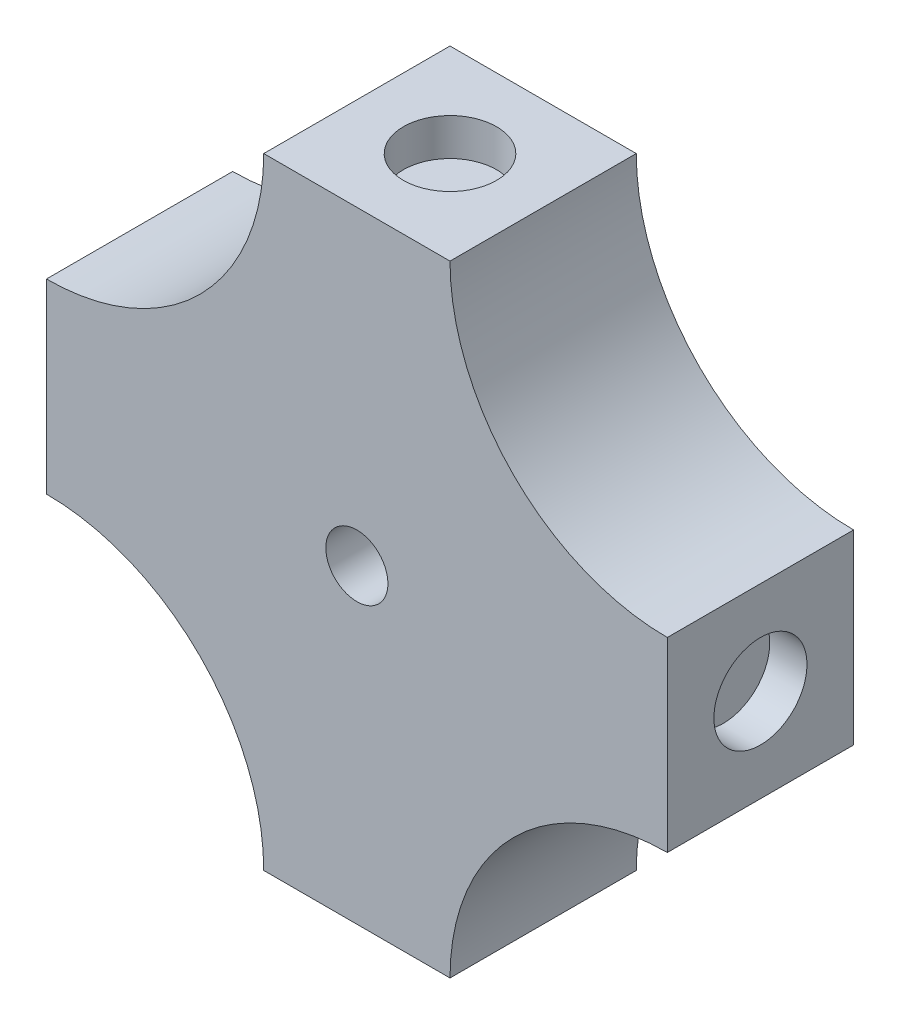
ISO-10303-21;
HEADER;
FILE_DESCRIPTION(('STEP AP214'),'2;1');
FILE_NAME('part.step','',(''),(''),'','','');
FILE_SCHEMA(('AUTOMOTIVE_DESIGN { 1 0 10303 214 1 1 1 1 }'));
ENDSEC;
DATA;
#1=APPLICATION_CONTEXT('core data for automotive mechanical design processes');
#2=APPLICATION_PROTOCOL_DEFINITION('international standard','automotive_design',2000,#1);
#3=PRODUCT_CONTEXT('',#1,'mechanical');
#4=PRODUCT('Part','Part','',(#3));
#5=PRODUCT_RELATED_PRODUCT_CATEGORY('part','',(#4));
#6=PRODUCT_DEFINITION_FORMATION('','',#4);
#7=PRODUCT_DEFINITION_CONTEXT('part definition',#1,'design');
#8=PRODUCT_DEFINITION('design','',#6,#7);
#9=PRODUCT_DEFINITION_SHAPE('','',#8);
#10=(LENGTH_UNIT() NAMED_UNIT(*) SI_UNIT(.MILLI.,.METRE.));
#11=(NAMED_UNIT(*) PLANE_ANGLE_UNIT() SI_UNIT($,.RADIAN.));
#12=(NAMED_UNIT(*) SI_UNIT($,.STERADIAN.) SOLID_ANGLE_UNIT());
#13=UNCERTAINTY_MEASURE_WITH_UNIT(LENGTH_MEASURE(1.E-05),#10,'distance_accuracy_value','');
#14=(GEOMETRIC_REPRESENTATION_CONTEXT(3) GLOBAL_UNCERTAINTY_ASSIGNED_CONTEXT((#13)) GLOBAL_UNIT_ASSIGNED_CONTEXT((#10,
#11,#12)) REPRESENTATION_CONTEXT('',''));
#15=CARTESIAN_POINT('',(0.,0.,0.));
#16=DIRECTION('',(0.,0.,1.));
#17=DIRECTION('',(1.,0.,0.));
#18=AXIS2_PLACEMENT_3D('',#15,#16,#17);
#19=CARTESIAN_POINT('',(-255.868433777415,125.088329621965,6.));
#20=DIRECTION('',(0.,0.,-1.));
#21=DIRECTION('',(-1.,0.,0.));
#22=AXIS2_PLACEMENT_3D('',#19,#20,#21);
#23=CYLINDRICAL_SURFACE('',#22,7.);
#24=DIRECTION('',(0.,0.,-1.));
#25=VECTOR('',#24,1.);
#26=CARTESIAN_POINT('',(-262.868433777415,125.088329621965,6.));
#27=LINE('',#26,#25);
#28=CARTESIAN_POINT('',(-262.868433777415,125.088329621965,6.));
#29=VERTEX_POINT('',#28);
#30=CARTESIAN_POINT('',(-262.868433777415,125.088329621965,0.));
#31=VERTEX_POINT('',#30);
#32=EDGE_CURVE('E152',#29,#31,#27,.T.);
#33=ORIENTED_EDGE('',*,*,#32,.T.);
#34=CARTESIAN_POINT('',(-255.868433777415,125.088329621965,0.));
#35=DIRECTION('',(0.,0.,1.));
#36=DIRECTION('',(1.,0.,0.));
#37=AXIS2_PLACEMENT_3D('',#34,#35,#36);
#38=CIRCLE('',#37,7.);
#39=CARTESIAN_POINT('',(-255.868433777415,132.088329621965,0.));
#40=VERTEX_POINT('',#39);
#41=EDGE_CURVE('E11',#31,#40,#38,.F.);
#42=ORIENTED_EDGE('',*,*,#41,.T.);
#43=DIRECTION('',(0.,0.,-1.));
#44=VECTOR('',#43,1.);
#45=CARTESIAN_POINT('',(-255.868433777415,132.088329621965,6.));
#46=LINE('',#45,#44);
#47=CARTESIAN_POINT('',(-255.868433777415,132.088329621965,6.));
#48=VERTEX_POINT('',#47);
#49=EDGE_CURVE('E149',#48,#40,#46,.T.);
#50=ORIENTED_EDGE('',*,*,#49,.F.);
#51=CARTESIAN_POINT('',(-255.868433777415,125.088329621965,6.));
#52=DIRECTION('',(0.,0.,1.));
#53=DIRECTION('',(1.,0.,0.));
#54=AXIS2_PLACEMENT_3D('',#51,#52,#53);
#55=CIRCLE('',#54,7.);
#56=EDGE_CURVE('E43',#48,#29,#55,.T.);
#57=ORIENTED_EDGE('',*,*,#56,.T.);
#58=EDGE_LOOP('',(#33,#42,#50,#57));
#59=FACE_BOUND('',#58,.T.);
#60=ADVANCED_FACE('F35',(#59),#23,.F.);
#61=CARTESIAN_POINT('',(-275.868433777415,125.088329621965,6.));
#62=DIRECTION('',(0.,0.,1.));
#63=DIRECTION('',(1.,0.,0.));
#64=AXIS2_PLACEMENT_3D('',#61,#62,#63);
#65=CYLINDRICAL_SURFACE('',#64,7.);
#66=DIRECTION('',(0.,0.,-1.));
#67=VECTOR('',#66,1.);
#68=CARTESIAN_POINT('',(-275.868433777415,132.088329621965,6.));
#69=LINE('',#68,#67);
#70=CARTESIAN_POINT('',(-275.868433777415,132.088329621965,6.));
#71=VERTEX_POINT('',#70);
#72=CARTESIAN_POINT('',(-275.868433777415,132.088329621965,0.));
#73=VERTEX_POINT('',#72);
#74=EDGE_CURVE('E115',#71,#73,#69,.T.);
#75=ORIENTED_EDGE('',*,*,#74,.T.);
#76=CARTESIAN_POINT('',(-275.868433777415,125.088329621965,0.));
#77=DIRECTION('',(0.,0.,1.));
#78=DIRECTION('',(1.,0.,0.));
#79=AXIS2_PLACEMENT_3D('',#76,#77,#78);
#80=CIRCLE('',#79,7.);
#81=CARTESIAN_POINT('',(-268.868433777415,125.088329621965,0.));
#82=VERTEX_POINT('',#81);
#83=EDGE_CURVE('E163',#73,#82,#80,.F.);
#84=ORIENTED_EDGE('',*,*,#83,.T.);
#85=DIRECTION('',(0.,0.,-1.));
#86=VECTOR('',#85,1.);
#87=CARTESIAN_POINT('',(-268.868433777415,125.088329621965,6.));
#88=LINE('',#87,#86);
#89=CARTESIAN_POINT('',(-268.868433777415,125.088329621965,6.));
#90=VERTEX_POINT('',#89);
#91=EDGE_CURVE('E155',#90,#82,#88,.T.);
#92=ORIENTED_EDGE('',*,*,#91,.F.);
#93=CARTESIAN_POINT('',(-275.868433777415,125.088329621965,6.));
#94=DIRECTION('',(0.,0.,1.));
#95=DIRECTION('',(1.,0.,0.));
#96=AXIS2_PLACEMENT_3D('',#93,#94,#95);
#97=CIRCLE('',#96,7.);
#98=EDGE_CURVE('E91',#90,#71,#97,.T.);
#99=ORIENTED_EDGE('',*,*,#98,.T.);
#100=EDGE_LOOP('',(#75,#84,#92,#99));
#101=FACE_BOUND('',#100,.T.);
#102=ADVANCED_FACE('F190',(#101),#65,.F.);
#103=CARTESIAN_POINT('',(-275.868433777415,145.088329621965,6.));
#104=DIRECTION('',(0.,0.,-1.));
#105=DIRECTION('',(-1.,0.,0.));
#106=AXIS2_PLACEMENT_3D('',#103,#104,#105);
#107=CYLINDRICAL_SURFACE('',#106,7.);
#108=DIRECTION('',(0.,0.,-1.));
#109=VECTOR('',#108,1.);
#110=CARTESIAN_POINT('',(-268.868433777415,145.088329621965,6.));
#111=LINE('',#110,#109);
#112=CARTESIAN_POINT('',(-268.868433777415,145.088329621965,6.));
#113=VERTEX_POINT('',#112);
#114=CARTESIAN_POINT('',(-268.868433777415,145.088329621965,0.));
#115=VERTEX_POINT('',#114);
#116=EDGE_CURVE('E123',#113,#115,#111,.T.);
#117=ORIENTED_EDGE('',*,*,#116,.T.);
#118=CARTESIAN_POINT('',(-275.868433777415,145.088329621965,0.));
#119=DIRECTION('',(0.,0.,1.));
#120=DIRECTION('',(1.,0.,0.));
#121=AXIS2_PLACEMENT_3D('',#118,#119,#120);
#122=CIRCLE('',#121,7.);
#123=CARTESIAN_POINT('',(-275.868433777415,138.088329621965,0.));
#124=VERTEX_POINT('',#123);
#125=EDGE_CURVE('E79',#115,#124,#122,.F.);
#126=ORIENTED_EDGE('',*,*,#125,.T.);
#127=DIRECTION('',(0.,0.,-1.));
#128=VECTOR('',#127,1.);
#129=CARTESIAN_POINT('',(-275.868433777415,138.088329621965,6.));
#130=LINE('',#129,#128);
#131=CARTESIAN_POINT('',(-275.868433777415,138.088329621965,6.));
#132=VERTEX_POINT('',#131);
#133=EDGE_CURVE('E127',#132,#124,#130,.T.);
#134=ORIENTED_EDGE('',*,*,#133,.F.);
#135=CARTESIAN_POINT('',(-275.868433777415,145.088329621965,6.));
#136=DIRECTION('',(0.,0.,1.));
#137=DIRECTION('',(1.,0.,0.));
#138=AXIS2_PLACEMENT_3D('',#135,#136,#137);
#139=CIRCLE('',#138,7.);
#140=EDGE_CURVE('E51',#132,#113,#139,.T.);
#141=ORIENTED_EDGE('',*,*,#140,.T.);
#142=EDGE_LOOP('',(#117,#126,#134,#141));
#143=FACE_BOUND('',#142,.T.);
#144=ADVANCED_FACE('F195',(#143),#107,.F.);
#145=CARTESIAN_POINT('',(-255.868433777415,145.088329621965,6.));
#146=DIRECTION('',(0.,0.,1.));
#147=DIRECTION('',(1.,0.,0.));
#148=AXIS2_PLACEMENT_3D('',#145,#146,#147);
#149=CYLINDRICAL_SURFACE('',#148,7.);
#150=DIRECTION('',(0.,0.,-1.));
#151=VECTOR('',#150,1.);
#152=CARTESIAN_POINT('',(-255.868433777415,138.088329621965,6.));
#153=LINE('',#152,#151);
#154=CARTESIAN_POINT('',(-255.868433777415,138.088329621965,6.));
#155=VERTEX_POINT('',#154);
#156=CARTESIAN_POINT('',(-255.868433777415,138.088329621965,0.));
#157=VERTEX_POINT('',#156);
#158=EDGE_CURVE('E122',#155,#157,#153,.T.);
#159=ORIENTED_EDGE('',*,*,#158,.T.);
#160=CARTESIAN_POINT('',(-255.868433777415,145.088329621965,0.));
#161=DIRECTION('',(0.,0.,1.));
#162=DIRECTION('',(1.,0.,0.));
#163=AXIS2_PLACEMENT_3D('',#160,#161,#162);
#164=CIRCLE('',#163,7.);
#165=CARTESIAN_POINT('',(-262.868433777415,145.088329621965,0.));
#166=VERTEX_POINT('',#165);
#167=EDGE_CURVE('E114',#157,#166,#164,.F.);
#168=ORIENTED_EDGE('',*,*,#167,.T.);
#169=DIRECTION('',(0.,0.,-1.));
#170=VECTOR('',#169,1.);
#171=CARTESIAN_POINT('',(-262.868433777415,145.088329621965,6.));
#172=LINE('',#171,#170);
#173=CARTESIAN_POINT('',(-262.868433777415,145.088329621965,6.));
#174=VERTEX_POINT('',#173);
#175=EDGE_CURVE('E118',#174,#166,#172,.T.);
#176=ORIENTED_EDGE('',*,*,#175,.F.);
#177=CARTESIAN_POINT('',(-255.868433777415,145.088329621965,6.));
#178=DIRECTION('',(0.,0.,1.));
#179=DIRECTION('',(1.,0.,0.));
#180=AXIS2_PLACEMENT_3D('',#177,#178,#179);
#181=CIRCLE('',#180,7.);
#182=EDGE_CURVE('E104',#174,#155,#181,.T.);
#183=ORIENTED_EDGE('',*,*,#182,.T.);
#184=EDGE_LOOP('',(#159,#168,#176,#183));
#185=FACE_BOUND('',#184,.T.);
#186=ADVANCED_FACE('F119',(#185),#149,.F.);
#187=CARTESIAN_POINT('',(-275.868433777415,0.,6.));
#188=DIRECTION('',(1.,0.,0.));
#189=DIRECTION('',(0.,0.,-1.));
#190=AXIS2_PLACEMENT_3D('',#187,#188,#189);
#191=PLANE('',#190);
#192=CARTESIAN_POINT('',(-275.868433777415,135.088329621965,3.));
#193=DIRECTION('',(-1.,0.,0.));
#194=DIRECTION('',(0.,0.,1.));
#195=AXIS2_PLACEMENT_3D('',#192,#193,#194);
#196=CIRCLE('',#195,1.5);
#197=CARTESIAN_POINT('',(-275.868433777415,135.088329621965,4.5));
#198=VERTEX_POINT('',#197);
#199=EDGE_CURVE('E210',#198,#198,#196,.T.);
#200=ORIENTED_EDGE('',*,*,#199,.F.);
#201=EDGE_LOOP('',(#200));
#202=FACE_BOUND('',#201,.T.);
#203=DIRECTION('',(0.,-1.,0.));
#204=VECTOR('',#203,1.);
#205=CARTESIAN_POINT('',(-275.868433777415,0.,0.));
#206=LINE('',#205,#204);
#207=EDGE_CURVE('E134',#124,#73,#206,.T.);
#208=ORIENTED_EDGE('',*,*,#207,.T.);
#209=ORIENTED_EDGE('',*,*,#74,.F.);
#210=DIRECTION('',(0.,-1.,0.));
#211=VECTOR('',#210,1.);
#212=CARTESIAN_POINT('',(-275.868433777415,0.,6.));
#213=LINE('',#212,#211);
#214=EDGE_CURVE('E145',#132,#71,#213,.T.);
#215=ORIENTED_EDGE('',*,*,#214,.F.);
#216=ORIENTED_EDGE('',*,*,#133,.T.);
#217=EDGE_LOOP('',(#208,#209,#215,#216));
#218=FACE_BOUND('',#217,.T.);
#219=ADVANCED_FACE('F185',(#202,#218),#191,.F.);
#220=CARTESIAN_POINT('',(0.,125.088329621965,6.));
#221=DIRECTION('',(0.,1.,0.));
#222=DIRECTION('',(0.,0.,1.));
#223=AXIS2_PLACEMENT_3D('',#220,#221,#222);
#224=PLANE('',#223);
#225=CARTESIAN_POINT('',(-265.868433777415,125.088329621965,3.));
#226=DIRECTION('',(0.,-1.,0.));
#227=DIRECTION('',(0.,0.,-1.));
#228=AXIS2_PLACEMENT_3D('',#225,#226,#227);
#229=CIRCLE('',#228,1.50000000000002);
#230=CARTESIAN_POINT('',(-265.868433777415,125.088329621965,1.49999999999998));
#231=VERTEX_POINT('',#230);
#232=EDGE_CURVE('E225',#231,#231,#229,.T.);
#233=ORIENTED_EDGE('',*,*,#232,.F.);
#234=EDGE_LOOP('',(#233));
#235=FACE_BOUND('',#234,.T.);
#236=DIRECTION('',(1.,0.,0.));
#237=VECTOR('',#236,1.);
#238=CARTESIAN_POINT('',(0.,125.088329621965,0.));
#239=LINE('',#238,#237);
#240=EDGE_CURVE('E137',#82,#31,#239,.T.);
#241=ORIENTED_EDGE('',*,*,#240,.T.);
#242=ORIENTED_EDGE('',*,*,#32,.F.);
#243=DIRECTION('',(1.,0.,0.));
#244=VECTOR('',#243,1.);
#245=CARTESIAN_POINT('',(0.,125.088329621965,6.));
#246=LINE('',#245,#244);
#247=EDGE_CURVE('E130',#90,#29,#246,.T.);
#248=ORIENTED_EDGE('',*,*,#247,.F.);
#249=ORIENTED_EDGE('',*,*,#91,.T.);
#250=EDGE_LOOP('',(#241,#242,#248,#249));
#251=FACE_BOUND('',#250,.T.);
#252=ADVANCED_FACE('F170',(#235,#251),#224,.F.);
#253=CARTESIAN_POINT('',(-255.868433777415,0.,6.));
#254=DIRECTION('',(1.,0.,0.));
#255=DIRECTION('',(0.,0.,-1.));
#256=AXIS2_PLACEMENT_3D('',#253,#254,#255);
#257=PLANE('',#256);
#258=CARTESIAN_POINT('',(-255.868433777415,135.088329621965,3.));
#259=DIRECTION('',(1.,0.,0.));
#260=DIRECTION('',(0.,0.,-1.));
#261=AXIS2_PLACEMENT_3D('',#258,#259,#260);
#262=CIRCLE('',#261,1.5);
#263=CARTESIAN_POINT('',(-255.868433777415,135.088329621965,1.5));
#264=VERTEX_POINT('',#263);
#265=EDGE_CURVE('E231',#264,#264,#262,.T.);
#266=ORIENTED_EDGE('',*,*,#265,.F.);
#267=EDGE_LOOP('',(#266));
#268=FACE_BOUND('',#267,.T.);
#269=DIRECTION('',(0.,-1.,0.));
#270=VECTOR('',#269,1.);
#271=CARTESIAN_POINT('',(-255.868433777415,0.,0.));
#272=LINE('',#271,#270);
#273=EDGE_CURVE('E141',#157,#40,#272,.T.);
#274=ORIENTED_EDGE('',*,*,#273,.F.);
#275=ORIENTED_EDGE('',*,*,#158,.F.);
#276=DIRECTION('',(0.,-1.,0.));
#277=VECTOR('',#276,1.);
#278=CARTESIAN_POINT('',(-255.868433777415,0.,6.));
#279=LINE('',#278,#277);
#280=EDGE_CURVE('E110',#155,#48,#279,.T.);
#281=ORIENTED_EDGE('',*,*,#280,.T.);
#282=ORIENTED_EDGE('',*,*,#49,.T.);
#283=EDGE_LOOP('',(#274,#275,#281,#282));
#284=FACE_BOUND('',#283,.T.);
#285=ADVANCED_FACE('F175',(#268,#284),#257,.T.);
#286=CARTESIAN_POINT('',(0.,145.088329621965,6.));
#287=DIRECTION('',(0.,1.,0.));
#288=DIRECTION('',(0.,0.,1.));
#289=AXIS2_PLACEMENT_3D('',#286,#287,#288);
#290=PLANE('',#289);
#291=CARTESIAN_POINT('',(-265.868433777415,145.088329621965,3.));
#292=DIRECTION('',(0.,1.,0.));
#293=DIRECTION('',(0.,0.,1.));
#294=AXIS2_PLACEMENT_3D('',#291,#292,#293);
#295=CIRCLE('',#294,1.50000000000002);
#296=CARTESIAN_POINT('',(-265.868433777415,145.088329621965,4.50000000000002));
#297=VERTEX_POINT('',#296);
#298=EDGE_CURVE('E215',#297,#297,#295,.T.);
#299=ORIENTED_EDGE('',*,*,#298,.F.);
#300=EDGE_LOOP('',(#299));
#301=FACE_BOUND('',#300,.T.);
#302=DIRECTION('',(1.,0.,0.));
#303=VECTOR('',#302,1.);
#304=CARTESIAN_POINT('',(0.,145.088329621965,0.));
#305=LINE('',#304,#303);
#306=EDGE_CURVE('E144',#115,#166,#305,.T.);
#307=ORIENTED_EDGE('',*,*,#306,.F.);
#308=ORIENTED_EDGE('',*,*,#116,.F.);
#309=DIRECTION('',(1.,0.,0.));
#310=VECTOR('',#309,1.);
#311=CARTESIAN_POINT('',(0.,145.088329621965,6.));
#312=LINE('',#311,#310);
#313=EDGE_CURVE('E108',#113,#174,#312,.T.);
#314=ORIENTED_EDGE('',*,*,#313,.T.);
#315=ORIENTED_EDGE('',*,*,#175,.T.);
#316=EDGE_LOOP('',(#307,#308,#314,#315));
#317=FACE_BOUND('',#316,.T.);
#318=ADVANCED_FACE('F126',(#301,#317),#290,.T.);
#319=CARTESIAN_POINT('',(0.,0.,6.));
#320=DIRECTION('',(0.,0.,1.));
#321=DIRECTION('',(1.,0.,0.));
#322=AXIS2_PLACEMENT_3D('',#319,#320,#321);
#323=PLANE('',#322);
#324=CARTESIAN_POINT('',(-265.868433777415,135.088329621965,6.));
#325=DIRECTION('',(0.,0.,-1.));
#326=DIRECTION('',(-1.,0.,0.));
#327=AXIS2_PLACEMENT_3D('',#324,#325,#326);
#328=CIRCLE('',#327,0.999999999999998);
#329=CARTESIAN_POINT('',(-266.868433777415,135.088329621965,6.));
#330=VERTEX_POINT('',#329);
#331=EDGE_CURVE('E234',#330,#330,#328,.T.);
#332=ORIENTED_EDGE('',*,*,#331,.T.);
#333=EDGE_LOOP('',(#332));
#334=FACE_BOUND('',#333,.T.);
#335=ORIENTED_EDGE('',*,*,#56,.F.);
#336=ORIENTED_EDGE('',*,*,#280,.F.);
#337=ORIENTED_EDGE('',*,*,#182,.F.);
#338=ORIENTED_EDGE('',*,*,#313,.F.);
#339=ORIENTED_EDGE('',*,*,#140,.F.);
#340=ORIENTED_EDGE('',*,*,#214,.T.);
#341=ORIENTED_EDGE('',*,*,#98,.F.);
#342=ORIENTED_EDGE('',*,*,#247,.T.);
#343=EDGE_LOOP('',(#335,#336,#337,#338,#339,#340,#341,#342));
#344=FACE_BOUND('',#343,.T.);
#345=ADVANCED_FACE('F106',(#334,#344),#323,.T.);
#346=CARTESIAN_POINT('',(0.,0.,0.));
#347=DIRECTION('',(0.,0.,1.));
#348=DIRECTION('',(1.,0.,0.));
#349=AXIS2_PLACEMENT_3D('',#346,#347,#348);
#350=PLANE('',#349);
#351=CARTESIAN_POINT('',(-265.868433777415,135.088329621965,0.));
#352=DIRECTION('',(0.,0.,-1.));
#353=DIRECTION('',(-1.,0.,0.));
#354=AXIS2_PLACEMENT_3D('',#351,#352,#353);
#355=CIRCLE('',#354,0.999999999999998);
#356=CARTESIAN_POINT('',(-266.868433777415,135.088329621965,0.));
#357=VERTEX_POINT('',#356);
#358=EDGE_CURVE('E237',#357,#357,#355,.T.);
#359=ORIENTED_EDGE('',*,*,#358,.F.);
#360=EDGE_LOOP('',(#359));
#361=FACE_BOUND('',#360,.T.);
#362=ORIENTED_EDGE('',*,*,#41,.F.);
#363=ORIENTED_EDGE('',*,*,#240,.F.);
#364=ORIENTED_EDGE('',*,*,#83,.F.);
#365=ORIENTED_EDGE('',*,*,#207,.F.);
#366=ORIENTED_EDGE('',*,*,#125,.F.);
#367=ORIENTED_EDGE('',*,*,#306,.T.);
#368=ORIENTED_EDGE('',*,*,#167,.F.);
#369=ORIENTED_EDGE('',*,*,#273,.T.);
#370=EDGE_LOOP('',(#362,#363,#364,#365,#366,#367,#368,#369));
#371=FACE_BOUND('',#370,.T.);
#372=ADVANCED_FACE('F172',(#361,#371),#350,.F.);
#373=CARTESIAN_POINT('',(-265.868433777415,143.888329621965,3.));
#374=DIRECTION('',(0.,1.,0.));
#375=DIRECTION('',(0.,0.,1.));
#376=AXIS2_PLACEMENT_3D('',#373,#374,#375);
#377=CYLINDRICAL_SURFACE('',#376,1.50000000000002);
#378=CARTESIAN_POINT('',(-265.868433777415,143.888329621965,3.));
#379=DIRECTION('',(0.,1.,0.));
#380=DIRECTION('',(0.,0.,1.));
#381=AXIS2_PLACEMENT_3D('',#378,#379,#380);
#382=CIRCLE('',#381,1.50000000000002);
#383=CARTESIAN_POINT('',(-265.868433777415,143.888329621965,4.50000000000002));
#384=VERTEX_POINT('',#383);
#385=EDGE_CURVE('E138',#384,#384,#382,.T.);
#386=ORIENTED_EDGE('',*,*,#385,.F.);
#387=EDGE_LOOP('',(#386));
#388=FACE_BOUND('',#387,.T.);
#389=ORIENTED_EDGE('',*,*,#298,.T.);
#390=EDGE_LOOP('',(#389));
#391=FACE_BOUND('',#390,.T.);
#392=ADVANCED_FACE('F252',(#388,#391),#377,.F.);
#393=CARTESIAN_POINT('',(-265.868433777415,143.888329621965,3.));
#394=DIRECTION('',(0.,1.,0.));
#395=DIRECTION('',(0.,0.,1.));
#396=AXIS2_PLACEMENT_3D('',#393,#394,#395);
#397=PLANE('',#396);
#398=ORIENTED_EDGE('',*,*,#385,.T.);
#399=EDGE_LOOP('',(#398));
#400=FACE_BOUND('',#399,.T.);
#401=ADVANCED_FACE('F259',(#400),#397,.T.);
#402=CARTESIAN_POINT('',(-274.668433777415,135.088329621965,3.));
#403=DIRECTION('',(-1.,0.,0.));
#404=DIRECTION('',(0.,0.,1.));
#405=AXIS2_PLACEMENT_3D('',#402,#403,#404);
#406=CYLINDRICAL_SURFACE('',#405,1.5);
#407=CARTESIAN_POINT('',(-274.668433777415,135.088329621965,3.));
#408=DIRECTION('',(-1.,0.,0.));
#409=DIRECTION('',(0.,0.,1.));
#410=AXIS2_PLACEMENT_3D('',#407,#408,#409);
#411=CIRCLE('',#410,1.5);
#412=CARTESIAN_POINT('',(-274.668433777415,135.088329621965,4.5));
#413=VERTEX_POINT('',#412);
#414=EDGE_CURVE('E218',#413,#413,#411,.T.);
#415=ORIENTED_EDGE('',*,*,#414,.F.);
#416=EDGE_LOOP('',(#415));
#417=FACE_BOUND('',#416,.T.);
#418=ORIENTED_EDGE('',*,*,#199,.T.);
#419=EDGE_LOOP('',(#418));
#420=FACE_BOUND('',#419,.T.);
#421=ADVANCED_FACE('F266',(#417,#420),#406,.F.);
#422=CARTESIAN_POINT('',(-274.668433777415,135.088329621965,3.));
#423=DIRECTION('',(-1.,0.,0.));
#424=DIRECTION('',(0.,0.,1.));
#425=AXIS2_PLACEMENT_3D('',#422,#423,#424);
#426=PLANE('',#425);
#427=ORIENTED_EDGE('',*,*,#414,.T.);
#428=EDGE_LOOP('',(#427));
#429=FACE_BOUND('',#428,.T.);
#430=ADVANCED_FACE('F270',(#429),#426,.T.);
#431=CARTESIAN_POINT('',(-265.868433777415,126.288329621965,3.));
#432=DIRECTION('',(0.,-1.,0.));
#433=DIRECTION('',(0.,0.,-1.));
#434=AXIS2_PLACEMENT_3D('',#431,#432,#433);
#435=CYLINDRICAL_SURFACE('',#434,1.50000000000002);
#436=CARTESIAN_POINT('',(-265.868433777415,126.288329621965,3.));
#437=DIRECTION('',(0.,-1.,0.));
#438=DIRECTION('',(0.,0.,-1.));
#439=AXIS2_PLACEMENT_3D('',#436,#437,#438);
#440=CIRCLE('',#439,1.50000000000002);
#441=CARTESIAN_POINT('',(-265.868433777415,126.288329621965,1.49999999999998));
#442=VERTEX_POINT('',#441);
#443=EDGE_CURVE('E222',#442,#442,#440,.T.);
#444=ORIENTED_EDGE('',*,*,#443,.F.);
#445=EDGE_LOOP('',(#444));
#446=FACE_BOUND('',#445,.T.);
#447=ORIENTED_EDGE('',*,*,#232,.T.);
#448=EDGE_LOOP('',(#447));
#449=FACE_BOUND('',#448,.T.);
#450=ADVANCED_FACE('F274',(#446,#449),#435,.F.);
#451=CARTESIAN_POINT('',(-265.868433777415,126.288329621965,3.));
#452=DIRECTION('',(0.,-1.,0.));
#453=DIRECTION('',(0.,0.,-1.));
#454=AXIS2_PLACEMENT_3D('',#451,#452,#453);
#455=PLANE('',#454);
#456=ORIENTED_EDGE('',*,*,#443,.T.);
#457=EDGE_LOOP('',(#456));
#458=FACE_BOUND('',#457,.T.);
#459=ADVANCED_FACE('F278',(#458),#455,.T.);
#460=CARTESIAN_POINT('',(-257.068433777415,135.088329621965,3.));
#461=DIRECTION('',(1.,0.,0.));
#462=DIRECTION('',(0.,0.,-1.));
#463=AXIS2_PLACEMENT_3D('',#460,#461,#462);
#464=CYLINDRICAL_SURFACE('',#463,1.5);
#465=CARTESIAN_POINT('',(-257.068433777415,135.088329621965,3.));
#466=DIRECTION('',(1.,0.,0.));
#467=DIRECTION('',(0.,0.,-1.));
#468=AXIS2_PLACEMENT_3D('',#465,#466,#467);
#469=CIRCLE('',#468,1.5);
#470=CARTESIAN_POINT('',(-257.068433777415,135.088329621965,1.5));
#471=VERTEX_POINT('',#470);
#472=EDGE_CURVE('E228',#471,#471,#469,.T.);
#473=ORIENTED_EDGE('',*,*,#472,.F.);
#474=EDGE_LOOP('',(#473));
#475=FACE_BOUND('',#474,.T.);
#476=ORIENTED_EDGE('',*,*,#265,.T.);
#477=EDGE_LOOP('',(#476));
#478=FACE_BOUND('',#477,.T.);
#479=ADVANCED_FACE('F282',(#475,#478),#464,.F.);
#480=CARTESIAN_POINT('',(-257.068433777415,135.088329621965,3.));
#481=DIRECTION('',(1.,0.,0.));
#482=DIRECTION('',(0.,0.,-1.));
#483=AXIS2_PLACEMENT_3D('',#480,#481,#482);
#484=PLANE('',#483);
#485=ORIENTED_EDGE('',*,*,#472,.T.);
#486=EDGE_LOOP('',(#485));
#487=FACE_BOUND('',#486,.T.);
#488=ADVANCED_FACE('F247',(#487),#484,.T.);
#489=CARTESIAN_POINT('',(-265.868433777415,135.088329621965,6.));
#490=DIRECTION('',(0.,0.,-1.));
#491=DIRECTION('',(-1.,0.,0.));
#492=AXIS2_PLACEMENT_3D('',#489,#490,#491);
#493=CYLINDRICAL_SURFACE('',#492,0.999999999999998);
#494=ORIENTED_EDGE('',*,*,#331,.F.);
#495=EDGE_LOOP('',(#494));
#496=FACE_BOUND('',#495,.T.);
#497=ORIENTED_EDGE('',*,*,#358,.T.);
#498=EDGE_LOOP('',(#497));
#499=FACE_BOUND('',#498,.T.);
#500=ADVANCED_FACE('F244',(#496,#499),#493,.F.);
#501=CLOSED_SHELL('',(#60,#102,#144,#186,#219,#252,#285,#318,#345,#372,#392,#401,#421,#430,#450,
#459,#479,#488,#500));
#502=MANIFOLD_SOLID_BREP('B2',#501);
#503=ADVANCED_BREP_SHAPE_REPRESENTATION('',(#18,#502),#14);
#504=SHAPE_DEFINITION_REPRESENTATION(#9,#503);
ENDSEC;
END-ISO-10303-21;
